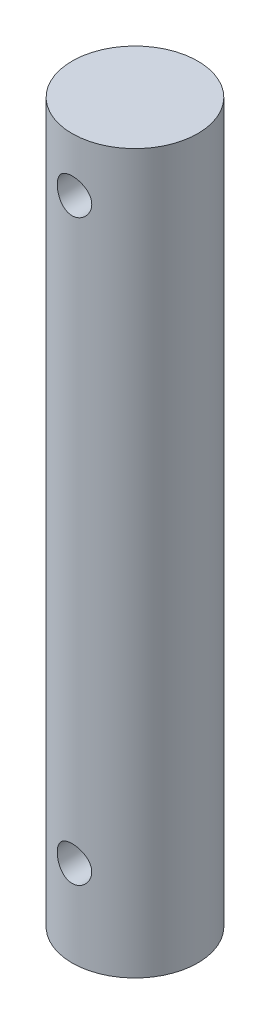
ISO-10303-21;
HEADER;
FILE_DESCRIPTION(('STEP AP214'),'2;1');
FILE_NAME('part.step','',(''),(''),'','','');
FILE_SCHEMA(('AUTOMOTIVE_DESIGN { 1 0 10303 214 1 1 1 1 }'));
ENDSEC;
DATA;
#1=APPLICATION_CONTEXT('core data for automotive mechanical design processes');
#2=APPLICATION_PROTOCOL_DEFINITION('international standard','automotive_design',2000,#1);
#3=PRODUCT_CONTEXT('',#1,'mechanical');
#4=PRODUCT('Part','Part','',(#3));
#5=PRODUCT_RELATED_PRODUCT_CATEGORY('part','',(#4));
#6=PRODUCT_DEFINITION_FORMATION('','',#4);
#7=PRODUCT_DEFINITION_CONTEXT('part definition',#1,'design');
#8=PRODUCT_DEFINITION('design','',#6,#7);
#9=PRODUCT_DEFINITION_SHAPE('','',#8);
#10=(LENGTH_UNIT() NAMED_UNIT(*) SI_UNIT(.MILLI.,.METRE.));
#11=(NAMED_UNIT(*) PLANE_ANGLE_UNIT() SI_UNIT($,.RADIAN.));
#12=(NAMED_UNIT(*) SI_UNIT($,.STERADIAN.) SOLID_ANGLE_UNIT());
#13=UNCERTAINTY_MEASURE_WITH_UNIT(LENGTH_MEASURE(1.E-05),#10,'distance_accuracy_value','');
#14=(GEOMETRIC_REPRESENTATION_CONTEXT(3) GLOBAL_UNCERTAINTY_ASSIGNED_CONTEXT((#13)) GLOBAL_UNIT_ASSIGNED_CONTEXT((#10,
#11,#12)) REPRESENTATION_CONTEXT('',''));
#15=CARTESIAN_POINT('',(0.,0.,0.));
#16=DIRECTION('',(0.,0.,1.));
#17=DIRECTION('',(1.,0.,0.));
#18=AXIS2_PLACEMENT_3D('',#15,#16,#17);
#19=CARTESIAN_POINT('',(0.,63.5,0.));
#20=DIRECTION('',(0.,-1.,0.));
#21=DIRECTION('',(0.,0.,-1.));
#22=AXIS2_PLACEMENT_3D('',#19,#20,#21);
#23=CYLINDRICAL_SURFACE('',#22,5.55625);
#24=CARTESIAN_POINT('',(0.,60.2615,-5.55625));
#25=CARTESIAN_POINT('',(-0.0839243274042605,60.2614981993074,-5.55624882927294));
#26=CARTESIAN_POINT('',(-0.167867613481108,60.2545444317299,-5.55432995065547));
#27=CARTESIAN_POINT('',(-0.333330188617833,60.2269659654338,-5.54686174318601));
#28=CARTESIAN_POINT('',(-0.41484839282272,60.2063352416653,-5.5413108143368));
#29=CARTESIAN_POINT('',(-0.573048949549515,60.1521284483651,-5.52719021743517));
#30=CARTESIAN_POINT('',(-0.649737580305424,60.1185696066005,-5.51862456804953));
#31=CARTESIAN_POINT('',(-0.796398529338007,60.0395245685796,-5.49937645772791));
#32=CARTESIAN_POINT('',(-0.866370297474207,59.9940373964775,-5.48869382362082));
#33=CARTESIAN_POINT('',(-0.999319283694709,59.8912550553382,-5.46607048298212));
#34=CARTESIAN_POINT('',(-1.06210920833413,59.8337225673862,-5.45410730472242));
#35=CARTESIAN_POINT('',(-1.17728133710283,59.7089896914591,-5.43041318256194));
#36=CARTESIAN_POINT('',(-1.22966211746745,59.6417879830906,-5.41868227062791));
#37=CARTESIAN_POINT('',(-1.32345791673896,59.4981097399127,-5.39654936725636));
#38=CARTESIAN_POINT('',(-1.3646546104725,59.4214859228072,-5.38617563863397));
#39=CARTESIAN_POINT('',(-1.43350548692102,59.2620686149973,-5.36826327411803));
#40=CARTESIAN_POINT('',(-1.46116232846057,59.179276339277,-5.36072408167333));
#41=CARTESIAN_POINT('',(-1.50149248412255,59.0119532149059,-5.34956689273426));
#42=CARTESIAN_POINT('',(-1.51450666910971,58.9275106115844,-5.34585986082083));
#43=CARTESIAN_POINT('',(-1.5262452131801,58.7575655449308,-5.34252094447796));
#44=CARTESIAN_POINT('',(-1.52497241089828,58.6720632955083,-5.3428882505314));
#45=CARTESIAN_POINT('',(-1.50844309109985,58.5051102833745,-5.34757698918831));
#46=CARTESIAN_POINT('',(-1.49360213219394,58.4236145481848,-5.35178090922778));
#47=CARTESIAN_POINT('',(-1.45102462477444,58.2643166730936,-5.36348061470836));
#48=CARTESIAN_POINT('',(-1.42328699250619,58.1865148442102,-5.37097667679728));
#49=CARTESIAN_POINT('',(-1.35537214758625,58.0357448153964,-5.38851725394586));
#50=CARTESIAN_POINT('',(-1.31505166939104,57.9628446783032,-5.39859086555452));
#51=CARTESIAN_POINT('',(-1.22321553044334,57.8247005449768,-5.42013622554189));
#52=CARTESIAN_POINT('',(-1.17169755151802,57.7594581384059,-5.43160826321474));
#53=CARTESIAN_POINT('',(-1.05681733719701,57.6361108096982,-5.45514428743246));
#54=CARTESIAN_POINT('',(-0.993106997980926,57.5783309048201,-5.46721502232855));
#55=CARTESIAN_POINT('',(-0.856752537903141,57.4742067740061,-5.49023340090312));
#56=CARTESIAN_POINT('',(-0.784108023579615,57.4278630519912,-5.50118099507941));
#57=CARTESIAN_POINT('',(-0.631424988575477,57.347772126302,-5.52079353773937));
#58=CARTESIAN_POINT('',(-0.551352559274145,57.3140866311623,-5.52944724479469));
#59=CARTESIAN_POINT('',(-0.386388936646241,57.2607504615616,-5.54341585122075));
#60=CARTESIAN_POINT('',(-0.301498864363421,57.2410965363556,-5.54873152389172));
#61=CARTESIAN_POINT('',(-0.132081052810919,57.2168984288311,-5.55530699804715));
#62=CARTESIAN_POINT('',(-0.0476208856908264,57.2119126822889,-5.55668529048076));
#63=CARTESIAN_POINT('',(0.120929807927628,57.215969039359,-5.55557289822189));
#64=CARTESIAN_POINT('',(0.205020374006143,57.2250096022993,-5.55308263845726));
#65=CARTESIAN_POINT('',(0.368848997837756,57.2565007570441,-5.54458974100724));
#66=CARTESIAN_POINT('',(0.448638585108351,57.2787024888591,-5.5386523262704));
#67=CARTESIAN_POINT('',(0.603351080798781,57.3355944955663,-5.52394113073766));
#68=CARTESIAN_POINT('',(0.678273445806871,57.3702861621057,-5.5151670338855));
#69=CARTESIAN_POINT('',(0.822820693886009,57.4519750222564,-5.49548122212863));
#70=CARTESIAN_POINT('',(0.892306156232266,57.4992090360108,-5.48452951452932));
#71=CARTESIAN_POINT('',(1.02251874875152,57.6043463442627,-5.46175304336441));
#72=CARTESIAN_POINT('',(1.08324404065646,57.6622518723228,-5.44992809733991));
#73=CARTESIAN_POINT('',(1.19609216047285,57.7891531440478,-5.42629762623539));
#74=CARTESIAN_POINT('',(1.24790272921415,57.8584291883159,-5.41450329841938));
#75=CARTESIAN_POINT('',(1.33917340547728,58.0049439710577,-5.39265605664099));
#76=CARTESIAN_POINT('',(1.37863400084672,58.0821823948417,-5.38260307389916));
#77=CARTESIAN_POINT('',(1.44378953392984,58.2420658250871,-5.36549357581121));
#78=CARTESIAN_POINT('',(1.46956208430331,58.3246773011952,-5.35842021405634));
#79=CARTESIAN_POINT('',(1.50678006719011,58.4932904319221,-5.34807518269966));
#80=CARTESIAN_POINT('',(1.5182294227727,58.5792911515801,-5.34480247213138));
#81=CARTESIAN_POINT('',(1.52624090954879,58.7490348210316,-5.34251977468923));
#82=CARTESIAN_POINT('',(1.52330637763806,58.8327524215023,-5.34336565837555));
#83=CARTESIAN_POINT('',(1.50380839065478,58.9984500204034,-5.3488853889634));
#84=CARTESIAN_POINT('',(1.48724532571574,59.0804300685046,-5.3535591262879));
#85=CARTESIAN_POINT('',(1.44125991905776,59.2396507000054,-5.36611966754493));
#86=CARTESIAN_POINT('',(1.41195006317309,59.3169261493091,-5.37397832529271));
#87=CARTESIAN_POINT('',(1.34139014616993,59.4655223936659,-5.39202250814459));
#88=CARTESIAN_POINT('',(1.30013811478295,59.5368422036298,-5.40220841714954));
#89=CARTESIAN_POINT('',(1.20536410660889,59.6738908034841,-5.42415369878218));
#90=CARTESIAN_POINT('',(1.15150145907919,59.739377789456,-5.43595205485115));
#91=CARTESIAN_POINT('',(1.03367543481418,59.8605471370316,-5.45958180950221));
#92=CARTESIAN_POINT('',(0.969709573359408,59.9162270796105,-5.47141321550743));
#93=CARTESIAN_POINT('',(0.831715889749731,60.0174664858372,-5.49410203830745));
#94=CARTESIAN_POINT('',(0.757490272137246,60.0627633525939,-5.50493075009454));
#95=CARTESIAN_POINT('',(0.602181813240705,60.1401655010184,-5.52407410513522));
#96=CARTESIAN_POINT('',(0.521103155250167,60.1722787612066,-5.5323902681384));
#97=CARTESIAN_POINT('',(0.367006263526613,60.2184948772894,-5.54457111499069));
#98=CARTESIAN_POINT('',(0.294615536455409,60.2345830389602,-5.54891787666377));
#99=CARTESIAN_POINT('',(0.14815467190509,60.2560857994387,-5.55475767664331));
#100=CARTESIAN_POINT('',(0.0740847228064985,60.2615015895726,-5.55625103346661));
#101=CARTESIAN_POINT('',(0.,60.2615,-5.55625));
#102=B_SPLINE_CURVE_WITH_KNOTS('',3,(#24,#25,#26,#27,#28,#29,#30,#31,#32,#33,#34,#35,#36,#37,
#38,#39,#40,#41,#42,#43,#44,#45,#46,#47,#48,#49,#50,#51,#52,#53,#54,#55,#56,#57,#58,#59,#60,#61,
#62,#63,#64,#65,#66,#67,#68,#69,#70,#71,#72,#73,#74,#75,#76,#77,#78,#79,#80,#81,#82,#83,#84,#85,
#86,#87,#88,#89,#90,#91,#92,#93,#94,#95,#96,#97,#98,#99,#100,#101),.UNSPECIFIED.,.T.,.F.,(4,2,2,
2,2,2,2,2,2,2,2,2,2,2,2,2,2,2,2,2,2,2,2,2,2,2,2,2,2,2,2,2,2,2,2,2,2,2,4),(0.,0.251501199213716,
0.503113264841163,0.754391190344412,1.00568967908189,1.26250543026143,1.5193562846045,
1.78090970140115,2.04241173625783,2.29769138396881,2.55292031189629,2.80058492434026,
3.04827035271031,3.29888562977406,3.54955284019772,3.80889216152386,4.06824290826825,
4.32884206806182,4.58938083428701,4.84199189298689,5.09457520645361,5.34252836207593,
5.5905091535655,5.8435538696523,6.0966516086208,6.35733261546726,6.61800332361465,
6.8771797807112,7.1362852347964,7.38638986963814,7.63648734517623,7.88442121500447,
8.13239601330179,8.38805664239397,8.64378024520015,8.90539297476191,9.16684714600983,
9.38888618327887,9.61090043356292),.UNSPECIFIED.);
#103=CARTESIAN_POINT('',(0.,60.2615,-5.55625));
#104=VERTEX_POINT('',#103);
#105=EDGE_CURVE('E10',#104,#104,#102,.T.);
#106=ORIENTED_EDGE('',*,*,#105,.T.);
#107=EDGE_LOOP('',(#106));
#108=FACE_BOUND('',#107,.T.);
#109=CARTESIAN_POINT('',(1.524,58.7375,5.34315806078203));
#110=CARTESIAN_POINT('',(1.52399816833775,58.6536426635341,5.34315941810247));
#111=CARTESIAN_POINT('',(1.51705511226946,58.5697663123163,5.34515377744604));
#112=CARTESIAN_POINT('',(1.48952304253656,58.4044425089779,5.35289015791346));
#113=CARTESIAN_POINT('',(1.46892769632138,58.3229962023512,5.35863391816043));
#114=CARTESIAN_POINT('',(1.41482426278522,58.1649482516475,5.37317072542769));
#115=CARTESIAN_POINT('',(1.38133504918774,58.0883397160636,5.38195931362969));
#116=CARTESIAN_POINT('',(1.30245434054345,57.9418147862641,5.40158976640219));
#117=CARTESIAN_POINT('',(1.25706172631205,57.8718990221622,5.41243182401788));
#118=CARTESIAN_POINT('',(1.15437813864967,57.7388945261991,5.43526909544026));
#119=CARTESIAN_POINT('',(1.09682853873584,57.6760090897958,5.44728568862049));
#120=CARTESIAN_POINT('',(0.97202039710798,57.5606504354611,5.47093396159151));
#121=CARTESIAN_POINT('',(0.904760800373776,57.5081783504445,5.48256559938672));
#122=CARTESIAN_POINT('',(0.761024229955035,57.4142805138648,5.50437290503279));
#123=CARTESIAN_POINT('',(0.684409841659551,57.3730580055638,5.5145204178342));
#124=CARTESIAN_POINT('',(0.525012541295402,57.3041568881603,5.53197014500868));
#125=CARTESIAN_POINT('',(0.442230735174042,57.2764758574908,5.53927286805627));
#126=CARTESIAN_POINT('',(0.274971592318372,57.2361046495089,5.55005900415462));
#127=CARTESIAN_POINT('',(0.190583567347833,57.2230683847379,5.55363044585493));
#128=CARTESIAN_POINT('',(0.0207477400907189,57.2112667078023,5.55685988222459));
#129=CARTESIAN_POINT('',(-0.0646998722733374,57.2124987740573,5.55651856837839));
#130=CARTESIAN_POINT('',(-0.231816279019828,57.2289575593123,5.55202495351416));
#131=CARTESIAN_POINT('',(-0.313525077460531,57.2438101811932,5.5479745297692));
#132=CARTESIAN_POINT('',(-0.473242734899587,57.2864826330898,5.53663879955745));
#133=CARTESIAN_POINT('',(-0.551251376716405,57.3143032232283,5.52935330346678));
#134=CARTESIAN_POINT('',(-0.702294851027772,57.3824011466986,5.51221718419817));
#135=CARTESIAN_POINT('',(-0.775269906878729,57.4228043211324,5.50234081393159));
#136=CARTESIAN_POINT('',(-0.913530134809491,57.5148233332234,5.48108354612888));
#137=CARTESIAN_POINT('',(-0.978813729397909,57.5664414648756,5.46970234096875));
#138=CARTESIAN_POINT('',(-1.10207116119662,57.6814013276567,5.44622999085762));
#139=CARTESIAN_POINT('',(-1.15973930813282,57.7450689504914,5.4341277921692));
#140=CARTESIAN_POINT('',(-1.26365720776398,57.881295518428,5.41090819574316));
#141=CARTESIAN_POINT('',(-1.30990617823429,57.9538550721265,5.39979086550342));
#142=CARTESIAN_POINT('',(-1.38992383136705,58.1064993070958,5.3797533900604));
#143=CARTESIAN_POINT('',(-1.42360483707505,58.1866321392141,5.37084882024921));
#144=CARTESIAN_POINT('',(-1.47691439394927,58.3517290868255,5.35643622584646));
#145=CARTESIAN_POINT('',(-1.49654666394411,58.4366919173409,5.35092730244986));
#146=CARTESIAN_POINT('',(-1.52066487732922,58.6061669372507,5.34412252677493));
#147=CARTESIAN_POINT('',(-1.52560873389226,58.6906089173438,5.34269935004931));
#148=CARTESIAN_POINT('',(-1.52147519923593,58.8591139361989,5.34387801574711));
#149=CARTESIAN_POINT('',(-1.51239939934314,58.9431770168825,5.34647940135533));
#150=CARTESIAN_POINT('',(-1.48088883607337,59.1067424813358,5.35529064753445));
#151=CARTESIAN_POINT('',(-1.45873355718454,59.1863031773988,5.36142495097166));
#152=CARTESIAN_POINT('',(-1.40200931185635,59.3405781076743,5.37653605167271));
#153=CARTESIAN_POINT('',(-1.36743865594816,59.4152916806619,5.3855132357725));
#154=CARTESIAN_POINT('',(-1.28594890708857,59.5596556648071,5.40555674374057));
#155=CARTESIAN_POINT('',(-1.23876324244313,59.6291494310918,5.41666650060782));
#156=CARTESIAN_POINT('',(-1.13371024147767,59.7594005601888,5.43962318863844));
#157=CARTESIAN_POINT('',(-1.07584077660519,59.8201561777855,5.4514702663872));
#158=CARTESIAN_POINT('',(-0.94893709602465,59.9331293780828,5.4750083131647));
#159=CARTESIAN_POINT('',(-0.879613955130428,59.9850264378756,5.48668324147607));
#160=CARTESIAN_POINT('',(-0.732976059744214,60.0764494356101,5.50818873122632));
#161=CARTESIAN_POINT('',(-0.655661730321701,60.1159760311149,5.51801939068783));
#162=CARTESIAN_POINT('',(-0.495779467362988,60.1811663536928,5.5346653466112));
#163=CARTESIAN_POINT('',(-0.413256599149014,60.2069345401481,5.54150329121973));
#164=CARTESIAN_POINT('',(-0.24483509585506,60.2441735430444,5.55149321901716));
#165=CARTESIAN_POINT('',(-0.158937260620094,60.2556477262381,5.55464607016752));
#166=CARTESIAN_POINT('',(0.0108088965678677,60.2637519990924,5.5568669589549));
#167=CARTESIAN_POINT('',(0.0946334508767204,60.2608509912944,5.55606403455116));
#168=CARTESIAN_POINT('',(0.260554156512236,60.2413830207378,5.55075810383556));
#169=CARTESIAN_POINT('',(0.342650379415673,60.2248166250611,5.54625525106217));
#170=CARTESIAN_POINT('',(0.502185417404088,60.1787592830199,5.53408359766452));
#171=CARTESIAN_POINT('',(0.57965509768905,60.1493683359591,5.52643931859486));
#172=CARTESIAN_POINT('',(0.728607418276182,60.0785852034411,5.50878181387809));
#173=CARTESIAN_POINT('',(0.80008918065326,60.0371912621075,5.49876824167477));
#174=CARTESIAN_POINT('',(0.937199610397862,59.9422322089823,5.47709107884905));
#175=CARTESIAN_POINT('',(1.00260936098067,59.8883597697316,5.46538925033646));
#176=CARTESIAN_POINT('',(1.12361856337732,59.770549297683,5.44180154601971));
#177=CARTESIAN_POINT('',(1.17921537880203,59.7066085685951,5.42991562168566));
#178=CARTESIAN_POINT('',(1.28032642233291,59.5686586568816,5.40698025075123));
#179=CARTESIAN_POINT('',(1.32557120376757,59.4944471759361,5.39595722357438));
#180=CARTESIAN_POINT('',(1.40287948777494,59.3391774353365,5.37637832131599));
#181=CARTESIAN_POINT('',(1.43495113271359,59.2581234425326,5.36782092319924));
#182=CARTESIAN_POINT('',(1.48108479794873,59.1041252652496,5.35525731925474));
#183=CARTESIAN_POINT('',(1.49713885498615,59.0318122114906,5.35075809136449));
#184=CARTESIAN_POINT('',(1.51859657222325,58.885504228918,5.34470805475607));
#185=CARTESIAN_POINT('',(1.52400161656033,58.8115095199475,5.34315686285901));
#186=CARTESIAN_POINT('',(1.524,58.7375,5.34315806078203));
#187=B_SPLINE_CURVE_WITH_KNOTS('',3,(#109,#110,#111,#112,#113,#114,#115,#116,#117,#118,#119,
#120,#121,#122,#123,#124,#125,#126,#127,#128,#129,#130,#131,#132,#133,#134,#135,#136,#137,#138,
#139,#140,#141,#142,#143,#144,#145,#146,#147,#148,#149,#150,#151,#152,#153,#154,#155,#156,#157,
#158,#159,#160,#161,#162,#163,#164,#165,#166,#167,#168,#169,#170,#171,#172,#173,#174,#175,#176,
#177,#178,#179,#180,#181,#182,#183,#184,#185,#186),.UNSPECIFIED.,.T.,.F.,(4,2,2,2,2,2,2,2,2,2,2,
2,2,2,2,2,2,2,2,2,2,2,2,2,2,2,2,2,2,2,2,2,2,2,2,2,2,2,4),(0.,0.25129968401282,0.502716013842934,
0.753765717303963,1.00483903349336,1.26191776165385,1.51902444323862,1.7805077724089,
2.04194432447612,2.29706330537927,2.55213720089796,2.8004085772176,3.04869450789521,
3.29954798325891,3.55045281854453,3.80949397091682,4.06855286293905,4.329386641543,
4.59015134949737,4.842696644693,5.09521327638241,5.3425200038236,5.58986039721172,
5.84290906380243,6.09600820024036,6.35690106341936,6.61778005624893,6.87664912293623,
7.13545720509662,7.3858799228398,7.63629224914312,7.88478593814152,8.13331599677645,
8.38877937017708,8.64431127343674,8.90588443434424,9.16729567169273,9.38911272001934,
9.61090093510663),.UNSPECIFIED.);
#188=CARTESIAN_POINT('',(1.524,58.7375,5.34315806078203));
#189=VERTEX_POINT('',#188);
#190=EDGE_CURVE('E41',#189,#189,#187,.T.);
#191=ORIENTED_EDGE('',*,*,#190,.T.);
#192=EDGE_LOOP('',(#191));
#193=FACE_BOUND('',#192,.T.);
#194=CARTESIAN_POINT('',(0.,9.144,-5.55625));
#195=CARTESIAN_POINT('',(-0.0839243274042605,9.1439981993074,-5.55624882927294));
#196=CARTESIAN_POINT('',(-0.167867613481108,9.1370444317299,-5.55432995065547));
#197=CARTESIAN_POINT('',(-0.333330188617832,9.10946596543379,-5.54686174318601));
#198=CARTESIAN_POINT('',(-0.41484839282272,9.08883524166532,-5.5413108143368));
#199=CARTESIAN_POINT('',(-0.573048949549514,9.03462844836515,-5.52719021743517));
#200=CARTESIAN_POINT('',(-0.649737580305422,9.00106960660053,-5.51862456804953));
#201=CARTESIAN_POINT('',(-0.796398529338006,8.9220245685796,-5.49937645772791));
#202=CARTESIAN_POINT('',(-0.866370297474207,8.87653739647749,-5.48869382362082));
#203=CARTESIAN_POINT('',(-0.99931928369471,8.77375505533822,-5.46607048298212));
#204=CARTESIAN_POINT('',(-1.06210920833413,8.71622256738624,-5.45410730472242));
#205=CARTESIAN_POINT('',(-1.17728133710283,8.59148969145912,-5.43041318256194));
#206=CARTESIAN_POINT('',(-1.22966211746745,8.52428798309057,-5.41868227062791));
#207=CARTESIAN_POINT('',(-1.32345791673896,8.38060973991275,-5.39654936725636));
#208=CARTESIAN_POINT('',(-1.3646546104725,8.30398592280721,-5.38617563863397));
#209=CARTESIAN_POINT('',(-1.43350548692102,8.1445686149973,-5.36826327411802));
#210=CARTESIAN_POINT('',(-1.46116232846058,8.061776339277,-5.36072408167333));
#211=CARTESIAN_POINT('',(-1.50149248412255,7.8944532149059,-5.34956689273426));
#212=CARTESIAN_POINT('',(-1.51450666910971,7.81001061158443,-5.34585986082083));
#213=CARTESIAN_POINT('',(-1.5262452131801,7.64006554493075,-5.34252094447796));
#214=CARTESIAN_POINT('',(-1.52497241089827,7.55456329550833,-5.3428882505314));
#215=CARTESIAN_POINT('',(-1.50844309109985,7.38761028337449,-5.34757698918831));
#216=CARTESIAN_POINT('',(-1.49360213219394,7.30611454818482,-5.35178090922778));
#217=CARTESIAN_POINT('',(-1.45102462477444,7.14681667309361,-5.36348061470836));
#218=CARTESIAN_POINT('',(-1.42328699250619,7.06901484421022,-5.37097667679728));
#219=CARTESIAN_POINT('',(-1.35537214758625,6.91824481539637,-5.38851725394586));
#220=CARTESIAN_POINT('',(-1.31505166939104,6.8453446783032,-5.39859086555452));
#221=CARTESIAN_POINT('',(-1.22321553044334,6.70720054497681,-5.42013622554189));
#222=CARTESIAN_POINT('',(-1.17169755151802,6.64195813840589,-5.43160826321474));
#223=CARTESIAN_POINT('',(-1.05681733719701,6.51861080969822,-5.45514428743246));
#224=CARTESIAN_POINT('',(-0.993106997980926,6.46083090482009,-5.46721502232855));
#225=CARTESIAN_POINT('',(-0.856752537903141,6.35670677400615,-5.49023340090312));
#226=CARTESIAN_POINT('',(-0.784108023579616,6.3103630519912,-5.50118099507941));
#227=CARTESIAN_POINT('',(-0.631424988575478,6.23027212630196,-5.52079353773937));
#228=CARTESIAN_POINT('',(-0.551352559274146,6.1965866311623,-5.52944724479469));
#229=CARTESIAN_POINT('',(-0.386388936646241,6.14325046156165,-5.54341585122075));
#230=CARTESIAN_POINT('',(-0.30149886436342,6.12359653635557,-5.54873152389172));
#231=CARTESIAN_POINT('',(-0.132081052810919,6.09939842883106,-5.55530699804715));
#232=CARTESIAN_POINT('',(-0.0476208856908266,6.09441268228894,-5.55668529048076));
#233=CARTESIAN_POINT('',(0.120929807927627,6.09846903935902,-5.55557289822189));
#234=CARTESIAN_POINT('',(0.205020374006141,6.10750960229926,-5.55308263845726));
#235=CARTESIAN_POINT('',(0.368848997837755,6.13900075704409,-5.54458974100724));
#236=CARTESIAN_POINT('',(0.44863858510835,6.16120248885913,-5.5386523262704));
#237=CARTESIAN_POINT('',(0.603351080798781,6.21809449556632,-5.52394113073766));
#238=CARTESIAN_POINT('',(0.67827344580687,6.25278616210574,-5.5151670338855));
#239=CARTESIAN_POINT('',(0.822820693886007,6.33447502225642,-5.49548122212863));
#240=CARTESIAN_POINT('',(0.892306156232264,6.38170903601079,-5.48452951452932));
#241=CARTESIAN_POINT('',(1.02251874875152,6.48684634426268,-5.46175304336442));
#242=CARTESIAN_POINT('',(1.08324404065646,6.54475187232282,-5.44992809733991));
#243=CARTESIAN_POINT('',(1.19609216047285,6.67165314404778,-5.42629762623539));
#244=CARTESIAN_POINT('',(1.24790272921415,6.74092918831593,-5.41450329841938));
#245=CARTESIAN_POINT('',(1.33917340547728,6.88744397105765,-5.39265605664099));
#246=CARTESIAN_POINT('',(1.37863400084672,6.9646823948417,-5.38260307389916));
#247=CARTESIAN_POINT('',(1.44378953392984,7.12456582508708,-5.36549357581121));
#248=CARTESIAN_POINT('',(1.46956208430331,7.20717730119525,-5.35842021405634));
#249=CARTESIAN_POINT('',(1.50678006719011,7.37579043192213,-5.34807518269966));
#250=CARTESIAN_POINT('',(1.5182294227727,7.46179115158007,-5.34480247213137));
#251=CARTESIAN_POINT('',(1.52624090954879,7.63153482103156,-5.34251977468923));
#252=CARTESIAN_POINT('',(1.52330637763806,7.71525242150227,-5.34336565837555));
#253=CARTESIAN_POINT('',(1.50380839065478,7.88095002040344,-5.3488853889634));
#254=CARTESIAN_POINT('',(1.48724532571573,7.96293006850456,-5.3535591262879));
#255=CARTESIAN_POINT('',(1.44125991905776,8.12215070000544,-5.36611966754493));
#256=CARTESIAN_POINT('',(1.41195006317309,8.19942614930915,-5.37397832529271));
#257=CARTESIAN_POINT('',(1.34139014616993,8.34802239366595,-5.39202250814459));
#258=CARTESIAN_POINT('',(1.30013811478295,8.41934220362979,-5.40220841714954));
#259=CARTESIAN_POINT('',(1.20536410660889,8.55639080348406,-5.42415369878218));
#260=CARTESIAN_POINT('',(1.15150145907919,8.62187778945602,-5.43595205485115));
#261=CARTESIAN_POINT('',(1.03367543481418,8.74304713703164,-5.45958180950221));
#262=CARTESIAN_POINT('',(0.969709573359413,8.79872707961045,-5.47141321550743));
#263=CARTESIAN_POINT('',(0.831715889749735,8.8999664858372,-5.49410203830745));
#264=CARTESIAN_POINT('',(0.757490272137251,8.94526335259389,-5.50493075009454));
#265=CARTESIAN_POINT('',(0.60218181324071,9.0226655010184,-5.52407410513522));
#266=CARTESIAN_POINT('',(0.52110315525017,9.05477876120663,-5.5323902681384));
#267=CARTESIAN_POINT('',(0.367006263526614,9.10099487728939,-5.54457111499069));
#268=CARTESIAN_POINT('',(0.29461553645541,9.11708303896018,-5.54891787666377));
#269=CARTESIAN_POINT('',(0.148154671905091,9.13858579943868,-5.55475767664331));
#270=CARTESIAN_POINT('',(0.0740847228064989,9.14400158957261,-5.55625103346661));
#271=CARTESIAN_POINT('',(0.,9.144,-5.55625));
#272=B_SPLINE_CURVE_WITH_KNOTS('',3,(#194,#195,#196,#197,#198,#199,#200,#201,#202,#203,#204,
#205,#206,#207,#208,#209,#210,#211,#212,#213,#214,#215,#216,#217,#218,#219,#220,#221,#222,#223,
#224,#225,#226,#227,#228,#229,#230,#231,#232,#233,#234,#235,#236,#237,#238,#239,#240,#241,#242,
#243,#244,#245,#246,#247,#248,#249,#250,#251,#252,#253,#254,#255,#256,#257,#258,#259,#260,#261,
#262,#263,#264,#265,#266,#267,#268,#269,#270,#271),.UNSPECIFIED.,.T.,.F.,(4,2,2,2,2,2,2,2,2,2,2,
2,2,2,2,2,2,2,2,2,2,2,2,2,2,2,2,2,2,2,2,2,2,2,2,2,2,2,4),(0.,0.251501199213716,
0.503113264841163,0.75439119034441,1.00568967908189,1.26250543026143,1.5193562846045,
1.78090970140115,2.04241173625783,2.29769138396881,2.55292031189629,2.80058492434026,
3.04827035271031,3.29888562977406,3.54955284019772,3.80889216152386,4.06824290826825,
4.32884206806183,4.58938083428701,4.84199189298689,5.09457520645361,5.34252836207593,
5.5905091535655,5.8435538696523,6.0966516086208,6.35733261546725,6.61800332361465,
6.8771797807112,7.1362852347964,7.38638986963814,7.63648734517624,7.88442121500447,
8.13239601330179,8.38805664239396,8.64378024520015,8.90539297476191,9.16684714600983,
9.38888618327887,9.61090043356292),.UNSPECIFIED.);
#273=CARTESIAN_POINT('',(0.,9.144,-5.55625));
#274=VERTEX_POINT('',#273);
#275=EDGE_CURVE('E45',#274,#274,#272,.T.);
#276=ORIENTED_EDGE('',*,*,#275,.T.);
#277=EDGE_LOOP('',(#276));
#278=FACE_BOUND('',#277,.T.);
#279=CARTESIAN_POINT('',(1.524,7.62,5.34315806078203));
#280=CARTESIAN_POINT('',(1.52399816833775,7.53614266353408,5.34315941810247));
#281=CARTESIAN_POINT('',(1.51705511226946,7.45226631231632,5.34515377744604));
#282=CARTESIAN_POINT('',(1.48952304253656,7.28694250897791,5.35289015791346));
#283=CARTESIAN_POINT('',(1.46892769632138,7.20549620235125,5.35863391816043));
#284=CARTESIAN_POINT('',(1.41482426278522,7.0474482516475,5.37317072542769));
#285=CARTESIAN_POINT('',(1.38133504918773,6.97083971606363,5.38195931362969));
#286=CARTESIAN_POINT('',(1.30245434054345,6.82431478626414,5.40158976640219));
#287=CARTESIAN_POINT('',(1.25706172631205,6.75439902216223,5.41243182401789));
#288=CARTESIAN_POINT('',(1.15437813864967,6.6213945261991,5.43526909544026));
#289=CARTESIAN_POINT('',(1.09682853873584,6.55850908979578,5.44728568862049));
#290=CARTESIAN_POINT('',(0.972020397107981,6.44315043546106,5.47093396159151));
#291=CARTESIAN_POINT('',(0.904760800373777,6.39067835044448,5.48256559938672));
#292=CARTESIAN_POINT('',(0.761024229955038,6.29678051386481,5.50437290503279));
#293=CARTESIAN_POINT('',(0.684409841659555,6.25555800556382,5.5145204178342));
#294=CARTESIAN_POINT('',(0.525012541295407,6.18665688816035,5.53197014500868));
#295=CARTESIAN_POINT('',(0.442230735174046,6.1589758574908,5.53927286805626));
#296=CARTESIAN_POINT('',(0.274971592318375,6.11860464950891,5.55005900415462));
#297=CARTESIAN_POINT('',(0.190583567347837,6.10556838473792,5.55363044585493));
#298=CARTESIAN_POINT('',(0.0207477400907209,6.09376670780229,5.55685988222459));
#299=CARTESIAN_POINT('',(-0.064699872273336,6.09499877405731,5.55651856837839));
#300=CARTESIAN_POINT('',(-0.231816279019828,6.11145755931228,5.55202495351416));
#301=CARTESIAN_POINT('',(-0.313525077460531,6.12631018119319,5.5479745297692));
#302=CARTESIAN_POINT('',(-0.473242734899586,6.16898263308985,5.53663879955745));
#303=CARTESIAN_POINT('',(-0.551251376716404,6.19680322322833,5.52935330346678));
#304=CARTESIAN_POINT('',(-0.70229485102777,6.26490114669857,5.51221718419817));
#305=CARTESIAN_POINT('',(-0.775269906878726,6.30530432113242,5.5023408139316));
#306=CARTESIAN_POINT('',(-0.913530134809488,6.39732333322338,5.48108354612888));
#307=CARTESIAN_POINT('',(-0.978813729397906,6.44894146487562,5.46970234096875));
#308=CARTESIAN_POINT('',(-1.10207116119661,6.56390132765668,5.44622999085762));
#309=CARTESIAN_POINT('',(-1.15973930813282,6.6275689504914,5.4341277921692));
#310=CARTESIAN_POINT('',(-1.26365720776398,6.76379551842797,5.41090819574316));
#311=CARTESIAN_POINT('',(-1.30990617823429,6.83635507212654,5.39979086550342));
#312=CARTESIAN_POINT('',(-1.38992383136705,6.98899930709583,5.3797533900604));
#313=CARTESIAN_POINT('',(-1.42360483707505,7.06913213921413,5.37084882024921));
#314=CARTESIAN_POINT('',(-1.47691439394926,7.23422908682545,5.35643622584647));
#315=CARTESIAN_POINT('',(-1.49654666394411,7.31919191734093,5.35092730244986));
#316=CARTESIAN_POINT('',(-1.52066487732922,7.48866693725069,5.34412252677493));
#317=CARTESIAN_POINT('',(-1.52560873389226,7.57310891734379,5.34269935004931));
#318=CARTESIAN_POINT('',(-1.52147519923593,7.74161393619894,5.34387801574711));
#319=CARTESIAN_POINT('',(-1.51239939934314,7.82567701688246,5.34647940135533));
#320=CARTESIAN_POINT('',(-1.48088883607337,7.98924248133576,5.35529064753445));
#321=CARTESIAN_POINT('',(-1.45873355718454,8.06880317739878,5.36142495097166));
#322=CARTESIAN_POINT('',(-1.40200931185635,8.22307810767427,5.37653605167271));
#323=CARTESIAN_POINT('',(-1.36743865594816,8.29779168066191,5.3855132357725));
#324=CARTESIAN_POINT('',(-1.28594890708856,8.44215566480707,5.40555674374057));
#325=CARTESIAN_POINT('',(-1.23876324244313,8.51164943109177,5.41666650060782));
#326=CARTESIAN_POINT('',(-1.13371024147767,8.64190056018881,5.43962318863844));
#327=CARTESIAN_POINT('',(-1.07584077660519,8.70265617778555,5.4514702663872));
#328=CARTESIAN_POINT('',(-0.948937096024654,8.81562937808278,5.4750083131647));
#329=CARTESIAN_POINT('',(-0.879613955130431,8.8675264378756,5.48668324147607));
#330=CARTESIAN_POINT('',(-0.732976059744216,8.95894943561011,5.50818873122632));
#331=CARTESIAN_POINT('',(-0.655661730321701,8.99847603111488,5.51801939068783));
#332=CARTESIAN_POINT('',(-0.495779467362987,9.06366635369281,5.5346653466112));
#333=CARTESIAN_POINT('',(-0.413256599149014,9.08943454014815,5.54150329121973));
#334=CARTESIAN_POINT('',(-0.244835095855061,9.1266735430444,5.55149321901716));
#335=CARTESIAN_POINT('',(-0.158937260620094,9.13814772623808,5.55464607016752));
#336=CARTESIAN_POINT('',(0.0108088965678669,9.14625199909235,5.5568669589549));
#337=CARTESIAN_POINT('',(0.0946334508767199,9.14335099129444,5.55606403455116));
#338=CARTESIAN_POINT('',(0.260554156512235,9.12388302073784,5.55075810383556));
#339=CARTESIAN_POINT('',(0.342650379415673,9.10731662506109,5.54625525106217));
#340=CARTESIAN_POINT('',(0.502185417404088,9.0612592830199,5.53408359766452));
#341=CARTESIAN_POINT('',(0.57965509768905,9.03186833595911,5.52643931859486));
#342=CARTESIAN_POINT('',(0.728607418276182,8.96108520344114,5.50878181387809));
#343=CARTESIAN_POINT('',(0.80008918065326,8.91969126210746,5.49876824167477));
#344=CARTESIAN_POINT('',(0.937199610397861,8.82473220898231,5.47709107884905));
#345=CARTESIAN_POINT('',(1.00260936098067,8.77085976973163,5.46538925033646));
#346=CARTESIAN_POINT('',(1.12361856337731,8.65304929768302,5.44180154601971));
#347=CARTESIAN_POINT('',(1.17921537880203,8.5891085685951,5.42991562168566));
#348=CARTESIAN_POINT('',(1.28032642233291,8.45115865688161,5.40698025075123));
#349=CARTESIAN_POINT('',(1.32557120376757,8.37694717593605,5.39595722357438));
#350=CARTESIAN_POINT('',(1.40287948777494,8.22167743533646,5.37637832131599));
#351=CARTESIAN_POINT('',(1.43495113271359,8.14062344253263,5.36782092319924));
#352=CARTESIAN_POINT('',(1.48108479794873,7.98662526524963,5.35525731925474));
#353=CARTESIAN_POINT('',(1.49713885498615,7.91431221149058,5.35075809136449));
#354=CARTESIAN_POINT('',(1.51859657222325,7.76800422891801,5.34470805475607));
#355=CARTESIAN_POINT('',(1.52400161656033,7.69400951994752,5.34315686285901));
#356=CARTESIAN_POINT('',(1.524,7.62,5.34315806078203));
#357=B_SPLINE_CURVE_WITH_KNOTS('',3,(#279,#280,#281,#282,#283,#284,#285,#286,#287,#288,#289,
#290,#291,#292,#293,#294,#295,#296,#297,#298,#299,#300,#301,#302,#303,#304,#305,#306,#307,#308,
#309,#310,#311,#312,#313,#314,#315,#316,#317,#318,#319,#320,#321,#322,#323,#324,#325,#326,#327,
#328,#329,#330,#331,#332,#333,#334,#335,#336,#337,#338,#339,#340,#341,#342,#343,#344,#345,#346,
#347,#348,#349,#350,#351,#352,#353,#354,#355,#356),.UNSPECIFIED.,.T.,.F.,(4,2,2,2,2,2,2,2,2,2,2,
2,2,2,2,2,2,2,2,2,2,2,2,2,2,2,2,2,2,2,2,2,2,2,2,2,2,2,4),(0.,0.251299684012811,
0.502716013842932,0.753765717303967,1.00483903349336,1.26191776165385,1.51902444323862,
1.7805077724089,2.04194432447611,2.29706330537927,2.55213720089796,2.8004085772176,
3.04869450789521,3.29954798325891,3.55045281854453,3.80949397091682,4.06855286293905,
4.32938664154298,4.59015134949737,4.842696644693,5.09521327638241,5.3425200038236,
5.58986039721173,5.84290906380244,6.09600820024036,6.35690106341936,6.61778005624894,
6.87664912293623,7.13545720509662,7.3858799228398,7.63629224914312,7.88478593814153,
8.13331599677645,8.38877937017708,8.64431127343674,8.90588443434424,9.16729567169273,
9.38911272001934,9.61090093510663),.UNSPECIFIED.);
#358=CARTESIAN_POINT('',(1.524,7.62,5.34315806078203));
#359=VERTEX_POINT('',#358);
#360=EDGE_CURVE('E49',#359,#359,#357,.T.);
#361=ORIENTED_EDGE('',*,*,#360,.T.);
#362=EDGE_LOOP('',(#361));
#363=FACE_BOUND('',#362,.T.);
#364=CARTESIAN_POINT('',(0.,63.5,0.));
#365=DIRECTION('',(0.,1.,0.));
#366=DIRECTION('',(0.,0.,1.));
#367=AXIS2_PLACEMENT_3D('',#364,#365,#366);
#368=CIRCLE('',#367,5.55625);
#369=CARTESIAN_POINT('',(0.,63.5,5.55625));
#370=VERTEX_POINT('',#369);
#371=EDGE_CURVE('E74',#370,#370,#368,.T.);
#372=ORIENTED_EDGE('',*,*,#371,.F.);
#373=EDGE_LOOP('',(#372));
#374=FACE_BOUND('',#373,.T.);
#375=CARTESIAN_POINT('',(0.,0.,0.));
#376=DIRECTION('',(0.,1.,0.));
#377=DIRECTION('',(0.,0.,1.));
#378=AXIS2_PLACEMENT_3D('',#375,#376,#377);
#379=CIRCLE('',#378,5.55625);
#380=CARTESIAN_POINT('',(0.,0.,5.55625));
#381=VERTEX_POINT('',#380);
#382=EDGE_CURVE('E75',#381,#381,#379,.T.);
#383=ORIENTED_EDGE('',*,*,#382,.T.);
#384=EDGE_LOOP('',(#383));
#385=FACE_BOUND('',#384,.T.);
#386=ADVANCED_FACE('F31',(#108,#193,#278,#363,#374,#385),#23,.T.);
#387=CARTESIAN_POINT('',(0.,63.5,0.));
#388=DIRECTION('',(0.,1.,0.));
#389=DIRECTION('',(0.,0.,1.));
#390=AXIS2_PLACEMENT_3D('',#387,#388,#389);
#391=PLANE('',#390);
#392=ORIENTED_EDGE('',*,*,#371,.T.);
#393=EDGE_LOOP('',(#392));
#394=FACE_BOUND('',#393,.T.);
#395=ADVANCED_FACE('F68',(#394),#391,.T.);
#396=CARTESIAN_POINT('',(0.,0.,0.));
#397=DIRECTION('',(0.,1.,0.));
#398=DIRECTION('',(0.,0.,1.));
#399=AXIS2_PLACEMENT_3D('',#396,#397,#398);
#400=PLANE('',#399);
#401=ORIENTED_EDGE('',*,*,#382,.F.);
#402=EDGE_LOOP('',(#401));
#403=FACE_BOUND('',#402,.T.);
#404=ADVANCED_FACE('F66',(#403),#400,.F.);
#405=CARTESIAN_POINT('',(0.,7.62,5.55625));
#406=DIRECTION('',(0.,0.,1.));
#407=DIRECTION('',(1.,0.,0.));
#408=AXIS2_PLACEMENT_3D('',#405,#406,#407);
#409=CYLINDRICAL_SURFACE('',#408,1.524);
#410=ORIENTED_EDGE('',*,*,#360,.F.);
#411=EDGE_LOOP('',(#410));
#412=FACE_BOUND('',#411,.T.);
#413=ORIENTED_EDGE('',*,*,#275,.F.);
#414=EDGE_LOOP('',(#413));
#415=FACE_BOUND('',#414,.T.);
#416=ADVANCED_FACE('F60',(#412,#415),#409,.F.);
#417=CARTESIAN_POINT('',(0.,58.7375,5.55625));
#418=DIRECTION('',(0.,0.,1.));
#419=DIRECTION('',(1.,0.,0.));
#420=AXIS2_PLACEMENT_3D('',#417,#418,#419);
#421=CYLINDRICAL_SURFACE('',#420,1.524);
#422=ORIENTED_EDGE('',*,*,#190,.F.);
#423=EDGE_LOOP('',(#422));
#424=FACE_BOUND('',#423,.T.);
#425=ORIENTED_EDGE('',*,*,#105,.F.);
#426=EDGE_LOOP('',(#425));
#427=FACE_BOUND('',#426,.T.);
#428=ADVANCED_FACE('F57',(#424,#427),#421,.F.);
#429=CLOSED_SHELL('',(#386,#395,#404,#416,#428));
#430=MANIFOLD_SOLID_BREP('B2',#429);
#431=ADVANCED_BREP_SHAPE_REPRESENTATION('',(#18,#430),#14);
#432=SHAPE_DEFINITION_REPRESENTATION(#9,#431);
ENDSEC;
END-ISO-10303-21;
